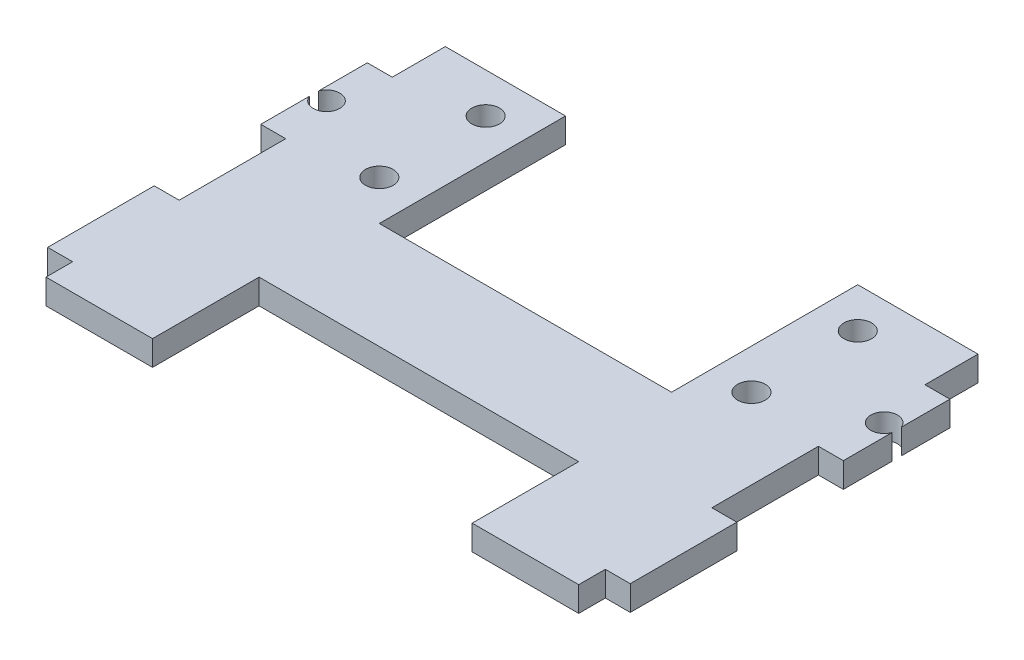
ISO-10303-21;
HEADER;
FILE_DESCRIPTION(('STEP AP214'),'2;1');
FILE_NAME('part.step','',(''),(''),'','','');
FILE_SCHEMA(('AUTOMOTIVE_DESIGN { 1 0 10303 214 1 1 1 1 }'));
ENDSEC;
DATA;
#1=APPLICATION_CONTEXT('core data for automotive mechanical design processes');
#2=APPLICATION_PROTOCOL_DEFINITION('international standard','automotive_design',2000,#1);
#3=PRODUCT_CONTEXT('',#1,'mechanical');
#4=PRODUCT('Part','Part','',(#3));
#5=PRODUCT_RELATED_PRODUCT_CATEGORY('part','',(#4));
#6=PRODUCT_DEFINITION_FORMATION('','',#4);
#7=PRODUCT_DEFINITION_CONTEXT('part definition',#1,'design');
#8=PRODUCT_DEFINITION('design','',#6,#7);
#9=PRODUCT_DEFINITION_SHAPE('','',#8);
#10=(LENGTH_UNIT() NAMED_UNIT(*) SI_UNIT(.MILLI.,.METRE.));
#11=(NAMED_UNIT(*) PLANE_ANGLE_UNIT() SI_UNIT($,.RADIAN.));
#12=(NAMED_UNIT(*) SI_UNIT($,.STERADIAN.) SOLID_ANGLE_UNIT());
#13=UNCERTAINTY_MEASURE_WITH_UNIT(LENGTH_MEASURE(1.E-05),#10,'distance_accuracy_value','');
#14=(GEOMETRIC_REPRESENTATION_CONTEXT(3) GLOBAL_UNCERTAINTY_ASSIGNED_CONTEXT((#13)) GLOBAL_UNIT_ASSIGNED_CONTEXT((#10,
#11,#12)) REPRESENTATION_CONTEXT('',''));
#15=CARTESIAN_POINT('',(0.,0.,0.));
#16=DIRECTION('',(0.,0.,1.));
#17=DIRECTION('',(1.,0.,0.));
#18=AXIS2_PLACEMENT_3D('',#15,#16,#17);
#19=CARTESIAN_POINT('',(-34.7218,2.9718,0.));
#20=DIRECTION('',(-1.,0.,0.));
#21=DIRECTION('',(0.,0.,1.));
#22=AXIS2_PLACEMENT_3D('',#19,#20,#21);
#23=PLANE('',#22);
#24=DIRECTION('',(0.,1.,0.));
#25=VECTOR('',#24,1.);
#26=CARTESIAN_POINT('',(-34.7218,0.,2.13338212915677));
#27=LINE('',#26,#25);
#28=CARTESIAN_POINT('',(-34.7218,0.,2.13338212915677));
#29=VERTEX_POINT('',#28);
#30=CARTESIAN_POINT('',(-34.7218,2.9718,2.13338212915677));
#31=VERTEX_POINT('',#30);
#32=EDGE_CURVE('E767',#29,#31,#27,.T.);
#33=ORIENTED_EDGE('',*,*,#32,.F.);
#34=DIRECTION('',(0.,0.,-1.));
#35=VECTOR('',#34,1.);
#36=CARTESIAN_POINT('',(-34.7218,0.,0.));
#37=LINE('',#36,#35);
#38=CARTESIAN_POINT('',(-34.7218,0.,7.92458212915679));
#39=VERTEX_POINT('',#38);
#40=EDGE_CURVE('E503',#39,#29,#37,.T.);
#41=ORIENTED_EDGE('',*,*,#40,.F.);
#42=DIRECTION('',(0.,-1.,0.));
#43=VECTOR('',#42,1.);
#44=CARTESIAN_POINT('',(-34.7218,2.9718,7.92458212915679));
#45=LINE('',#44,#43);
#46=CARTESIAN_POINT('',(-34.7218,2.9718,7.92458212915679));
#47=VERTEX_POINT('',#46);
#48=EDGE_CURVE('E455',#47,#39,#45,.T.);
#49=ORIENTED_EDGE('',*,*,#48,.F.);
#50=DIRECTION('',(0.,0.,-1.));
#51=VECTOR('',#50,1.);
#52=CARTESIAN_POINT('',(-34.7218,2.9718,0.));
#53=LINE('',#52,#51);
#54=EDGE_CURVE('E644',#47,#31,#53,.T.);
#55=ORIENTED_EDGE('',*,*,#54,.T.);
#56=EDGE_LOOP('',(#33,#41,#49,#55));
#57=FACE_BOUND('',#56,.T.);
#58=ADVANCED_FACE('F48',(#57),#23,.T.);
#59=CARTESIAN_POINT('',(34.7218,2.9718,0.));
#60=DIRECTION('',(-1.,0.,0.));
#61=DIRECTION('',(0.,0.,1.));
#62=AXIS2_PLACEMENT_3D('',#59,#60,#61);
#63=PLANE('',#62);
#64=DIRECTION('',(0.,0.,-1.));
#65=VECTOR('',#64,1.);
#66=CARTESIAN_POINT('',(34.7218,0.,0.));
#67=LINE('',#66,#65);
#68=CARTESIAN_POINT('',(34.7218,0.,7.92458212915679));
#69=VERTEX_POINT('',#68);
#70=CARTESIAN_POINT('',(34.7218,0.,2.13338212915677));
#71=VERTEX_POINT('',#70);
#72=EDGE_CURVE('E342',#69,#71,#67,.T.);
#73=ORIENTED_EDGE('',*,*,#72,.T.);
#74=DIRECTION('',(0.,1.,0.));
#75=VECTOR('',#74,1.);
#76=CARTESIAN_POINT('',(34.7218,0.,2.13338212915677));
#77=LINE('',#76,#75);
#78=CARTESIAN_POINT('',(34.7218,2.9718,2.13338212915677));
#79=VERTEX_POINT('',#78);
#80=EDGE_CURVE('E77',#71,#79,#77,.T.);
#81=ORIENTED_EDGE('',*,*,#80,.T.);
#82=DIRECTION('',(0.,0.,-1.));
#83=VECTOR('',#82,1.);
#84=CARTESIAN_POINT('',(34.7218,2.9718,0.));
#85=LINE('',#84,#83);
#86=CARTESIAN_POINT('',(34.7218,2.9718,7.92458212915679));
#87=VERTEX_POINT('',#86);
#88=EDGE_CURVE('E718',#87,#79,#85,.T.);
#89=ORIENTED_EDGE('',*,*,#88,.F.);
#90=DIRECTION('',(0.,-1.,0.));
#91=VECTOR('',#90,1.);
#92=CARTESIAN_POINT('',(34.7218,2.9718,7.92458212915679));
#93=LINE('',#92,#91);
#94=EDGE_CURVE('E398',#87,#69,#93,.T.);
#95=ORIENTED_EDGE('',*,*,#94,.T.);
#96=EDGE_LOOP('',(#73,#81,#89,#95));
#97=FACE_BOUND('',#96,.T.);
#98=ADVANCED_FACE('F826',(#97),#63,.F.);
#99=CARTESIAN_POINT('',(-17.4172874520488,2.9718,0.));
#100=DIRECTION('',(1.,0.,0.));
#101=DIRECTION('',(0.,0.,-1.));
#102=AXIS2_PLACEMENT_3D('',#99,#100,#101);
#103=PLANE('',#102);
#104=DIRECTION('',(0.,0.,1.));
#105=VECTOR('',#104,1.);
#106=CARTESIAN_POINT('',(-17.4172874520488,0.,0.));
#107=LINE('',#106,#105);
#108=CARTESIAN_POINT('',(-17.4172874520488,0.,-11.0995821291568));
#109=VERTEX_POINT('',#108);
#110=CARTESIAN_POINT('',(-17.4172874520488,0.,11.0995821291568));
#111=VERTEX_POINT('',#110);
#112=EDGE_CURVE('E483',#109,#111,#107,.T.);
#113=ORIENTED_EDGE('',*,*,#112,.F.);
#114=DIRECTION('',(0.,-1.,0.));
#115=VECTOR('',#114,1.);
#116=CARTESIAN_POINT('',(-17.4172874520488,2.9718,-11.0995821291568));
#117=LINE('',#116,#115);
#118=CARTESIAN_POINT('',(-17.4172874520488,2.9718,-11.0995821291568));
#119=VERTEX_POINT('',#118);
#120=EDGE_CURVE('E323',#119,#109,#117,.T.);
#121=ORIENTED_EDGE('',*,*,#120,.F.);
#122=DIRECTION('',(0.,0.,1.));
#123=VECTOR('',#122,1.);
#124=CARTESIAN_POINT('',(-17.4172874520488,2.9718,0.));
#125=LINE('',#124,#123);
#126=CARTESIAN_POINT('',(-17.4172874520488,2.9718,11.0995821291568));
#127=VERTEX_POINT('',#126);
#128=EDGE_CURVE('E623',#119,#127,#125,.T.);
#129=ORIENTED_EDGE('',*,*,#128,.T.);
#130=DIRECTION('',(0.,-1.,0.));
#131=VECTOR('',#130,1.);
#132=CARTESIAN_POINT('',(-17.4172874520488,2.9718,11.0995821291568));
#133=LINE('',#132,#131);
#134=EDGE_CURVE('E378',#127,#111,#133,.T.);
#135=ORIENTED_EDGE('',*,*,#134,.T.);
#136=EDGE_LOOP('',(#113,#121,#129,#135));
#137=FACE_BOUND('',#136,.T.);
#138=ADVANCED_FACE('F484',(#137),#103,.T.);
#139=CARTESIAN_POINT('',(0.,2.9718,-11.0995821291568));
#140=DIRECTION('',(0.,0.,-1.));
#141=DIRECTION('',(-1.,0.,0.));
#142=AXIS2_PLACEMENT_3D('',#139,#140,#141);
#143=PLANE('',#142);
#144=DIRECTION('',(1.,0.,0.));
#145=VECTOR('',#144,1.);
#146=CARTESIAN_POINT('',(0.,0.,-11.0995821291568));
#147=LINE('',#146,#145);
#148=CARTESIAN_POINT('',(-31.75,0.,-11.0995821291568));
#149=VERTEX_POINT('',#148);
#150=EDGE_CURVE('E476',#149,#109,#147,.T.);
#151=ORIENTED_EDGE('',*,*,#150,.F.);
#152=DIRECTION('',(0.,-1.,0.));
#153=VECTOR('',#152,1.);
#154=CARTESIAN_POINT('',(-31.75,2.9718,-11.0995821291568));
#155=LINE('',#154,#153);
#156=CARTESIAN_POINT('',(-31.75,2.9718,-11.0995821291568));
#157=VERTEX_POINT('',#156);
#158=EDGE_CURVE('E466',#157,#149,#155,.T.);
#159=ORIENTED_EDGE('',*,*,#158,.F.);
#160=DIRECTION('',(1.,0.,0.));
#161=VECTOR('',#160,1.);
#162=CARTESIAN_POINT('',(0.,2.9718,-11.0995821291568));
#163=LINE('',#162,#161);
#164=EDGE_CURVE('E478',#157,#119,#163,.T.);
#165=ORIENTED_EDGE('',*,*,#164,.T.);
#166=ORIENTED_EDGE('',*,*,#120,.T.);
#167=EDGE_LOOP('',(#151,#159,#165,#166));
#168=FACE_BOUND('',#167,.T.);
#169=ADVANCED_FACE('F474',(#168),#143,.T.);
#170=CARTESIAN_POINT('',(-31.75,2.9718,0.));
#171=DIRECTION('',(1.,0.,0.));
#172=DIRECTION('',(0.,0.,-1.));
#173=AXIS2_PLACEMENT_3D('',#170,#171,#172);
#174=PLANE('',#173);
#175=DIRECTION('',(0.,0.,1.));
#176=VECTOR('',#175,1.);
#177=CARTESIAN_POINT('',(-31.75,0.,0.));
#178=LINE('',#177,#176);
#179=CARTESIAN_POINT('',(-31.75,0.,-4.77541787084321));
#180=VERTEX_POINT('',#179);
#181=EDGE_CURVE('E491',#149,#180,#178,.T.);
#182=ORIENTED_EDGE('',*,*,#181,.T.);
#183=DIRECTION('',(0.,-1.,0.));
#184=VECTOR('',#183,1.);
#185=CARTESIAN_POINT('',(-31.75,2.9718,-4.77541787084321));
#186=LINE('',#185,#184);
#187=CARTESIAN_POINT('',(-31.75,2.9718,-4.77541787084321));
#188=VERTEX_POINT('',#187);
#189=EDGE_CURVE('E462',#188,#180,#186,.T.);
#190=ORIENTED_EDGE('',*,*,#189,.F.);
#191=DIRECTION('',(0.,0.,1.));
#192=VECTOR('',#191,1.);
#193=CARTESIAN_POINT('',(-31.75,2.9718,0.));
#194=LINE('',#193,#192);
#195=EDGE_CURVE('E615',#157,#188,#194,.T.);
#196=ORIENTED_EDGE('',*,*,#195,.F.);
#197=ORIENTED_EDGE('',*,*,#158,.T.);
#198=EDGE_LOOP('',(#182,#190,#196,#197));
#199=FACE_BOUND('',#198,.T.);
#200=ADVANCED_FACE('F614',(#199),#174,.F.);
#201=CARTESIAN_POINT('',(0.,2.9718,-4.77541787084323));
#202=DIRECTION('',(0.,0.,1.));
#203=DIRECTION('',(1.,0.,0.));
#204=AXIS2_PLACEMENT_3D('',#201,#202,#203);
#205=PLANE('',#204);
#206=DIRECTION('',(-1.,0.,0.));
#207=VECTOR('',#206,1.);
#208=CARTESIAN_POINT('',(0.,0.,-4.77541787084323));
#209=LINE('',#208,#207);
#210=CARTESIAN_POINT('',(-34.7218,0.,-4.77541787084321));
#211=VERTEX_POINT('',#210);
#212=EDGE_CURVE('E495',#180,#211,#209,.T.);
#213=ORIENTED_EDGE('',*,*,#212,.T.);
#214=DIRECTION('',(0.,-1.,0.));
#215=VECTOR('',#214,1.);
#216=CARTESIAN_POINT('',(-34.7218,2.9718,-4.77541787084321));
#217=LINE('',#216,#215);
#218=CARTESIAN_POINT('',(-34.7218,2.9718,-4.77541787084321));
#219=VERTEX_POINT('',#218);
#220=EDGE_CURVE('E458',#219,#211,#217,.T.);
#221=ORIENTED_EDGE('',*,*,#220,.F.);
#222=DIRECTION('',(-1.,0.,0.));
#223=VECTOR('',#222,1.);
#224=CARTESIAN_POINT('',(0.,2.9718,-4.77541787084323));
#225=LINE('',#224,#223);
#226=EDGE_CURVE('E610',#188,#219,#225,.T.);
#227=ORIENTED_EDGE('',*,*,#226,.F.);
#228=ORIENTED_EDGE('',*,*,#189,.T.);
#229=EDGE_LOOP('',(#213,#221,#227,#228));
#230=FACE_BOUND('',#229,.T.);
#231=ADVANCED_FACE('F608',(#230),#205,.F.);
#232=DIRECTION('',(0.,1.,0.));
#233=VECTOR('',#232,1.);
#234=CARTESIAN_POINT('',(-34.7218,0.,1.01578212915681));
#235=LINE('',#234,#233);
#236=CARTESIAN_POINT('',(-34.7218,2.9718,1.01578212915681));
#237=VERTEX_POINT('',#236);
#238=CARTESIAN_POINT('',(-34.7218,0.,1.01578212915681));
#239=VERTEX_POINT('',#238);
#240=EDGE_CURVE('E67',#237,#239,#235,.F.);
#241=ORIENTED_EDGE('',*,*,#240,.F.);
#242=EDGE_CURVE('E605',#237,#219,#53,.T.);
#243=ORIENTED_EDGE('',*,*,#242,.T.);
#244=ORIENTED_EDGE('',*,*,#220,.T.);
#245=EDGE_CURVE('E502',#239,#211,#37,.T.);
#246=ORIENTED_EDGE('',*,*,#245,.F.);
#247=EDGE_LOOP('',(#241,#243,#244,#246));
#248=FACE_BOUND('',#247,.T.);
#249=ADVANCED_FACE('F603',(#248),#23,.T.);
#250=CARTESIAN_POINT('',(0.,2.9718,7.92458212915679));
#251=DIRECTION('',(0.,0.,1.));
#252=DIRECTION('',(1.,0.,0.));
#253=AXIS2_PLACEMENT_3D('',#250,#251,#252);
#254=PLANE('',#253);
#255=DIRECTION('',(-1.,0.,0.));
#256=VECTOR('',#255,1.);
#257=CARTESIAN_POINT('',(0.,0.,7.92458212915679));
#258=LINE('',#257,#256);
#259=CARTESIAN_POINT('',(-31.75,0.,7.92458212915679));
#260=VERTEX_POINT('',#259);
#261=EDGE_CURVE('E506',#260,#39,#258,.T.);
#262=ORIENTED_EDGE('',*,*,#261,.F.);
#263=DIRECTION('',(0.,-1.,0.));
#264=VECTOR('',#263,1.);
#265=CARTESIAN_POINT('',(-31.75,2.9718,7.92458212915679));
#266=LINE('',#265,#264);
#267=CARTESIAN_POINT('',(-31.75,2.9718,7.92458212915679));
#268=VERTEX_POINT('',#267);
#269=EDGE_CURVE('E452',#268,#260,#266,.T.);
#270=ORIENTED_EDGE('',*,*,#269,.F.);
#271=DIRECTION('',(-1.,0.,0.));
#272=VECTOR('',#271,1.);
#273=CARTESIAN_POINT('',(0.,2.9718,7.92458212915679));
#274=LINE('',#273,#272);
#275=EDGE_CURVE('E649',#268,#47,#274,.T.);
#276=ORIENTED_EDGE('',*,*,#275,.T.);
#277=ORIENTED_EDGE('',*,*,#48,.T.);
#278=EDGE_LOOP('',(#262,#270,#276,#277));
#279=FACE_BOUND('',#278,.T.);
#280=ADVANCED_FACE('F837',(#279),#254,.T.);
#281=CARTESIAN_POINT('',(-31.75,2.9718,0.));
#282=DIRECTION('',(1.,0.,0.));
#283=DIRECTION('',(0.,0.,-1.));
#284=AXIS2_PLACEMENT_3D('',#281,#282,#283);
#285=PLANE('',#284);
#286=DIRECTION('',(0.,0.,1.));
#287=VECTOR('',#286,1.);
#288=CARTESIAN_POINT('',(-31.75,0.,0.));
#289=LINE('',#288,#287);
#290=CARTESIAN_POINT('',(-31.75,0.,20.6245821291568));
#291=VERTEX_POINT('',#290);
#292=EDGE_CURVE('E510',#260,#291,#289,.T.);
#293=ORIENTED_EDGE('',*,*,#292,.T.);
#294=DIRECTION('',(0.,-1.,0.));
#295=VECTOR('',#294,1.);
#296=CARTESIAN_POINT('',(-31.75,2.9718,20.6245821291568));
#297=LINE('',#296,#295);
#298=CARTESIAN_POINT('',(-31.75,2.9718,20.6245821291568));
#299=VERTEX_POINT('',#298);
#300=EDGE_CURVE('E448',#299,#291,#297,.T.);
#301=ORIENTED_EDGE('',*,*,#300,.F.);
#302=DIRECTION('',(0.,0.,1.));
#303=VECTOR('',#302,1.);
#304=CARTESIAN_POINT('',(-31.75,2.9718,0.));
#305=LINE('',#304,#303);
#306=EDGE_CURVE('E661',#268,#299,#305,.T.);
#307=ORIENTED_EDGE('',*,*,#306,.F.);
#308=ORIENTED_EDGE('',*,*,#269,.T.);
#309=EDGE_LOOP('',(#293,#301,#307,#308));
#310=FACE_BOUND('',#309,.T.);
#311=ADVANCED_FACE('F842',(#310),#285,.F.);
#312=CARTESIAN_POINT('',(0.,2.9718,20.6245821291568));
#313=DIRECTION('',(0.,0.,1.));
#314=DIRECTION('',(1.,0.,0.));
#315=AXIS2_PLACEMENT_3D('',#312,#313,#314);
#316=PLANE('',#315);
#317=DIRECTION('',(-1.,0.,0.));
#318=VECTOR('',#317,1.);
#319=CARTESIAN_POINT('',(0.,0.,20.6245821291568));
#320=LINE('',#319,#318);
#321=CARTESIAN_POINT('',(-34.7218,0.,20.6245821291568));
#322=VERTEX_POINT('',#321);
#323=EDGE_CURVE('E514',#291,#322,#320,.T.);
#324=ORIENTED_EDGE('',*,*,#323,.T.);
#325=DIRECTION('',(0.,-1.,0.));
#326=VECTOR('',#325,1.);
#327=CARTESIAN_POINT('',(-34.7218,2.9718,20.6245821291568));
#328=LINE('',#327,#326);
#329=CARTESIAN_POINT('',(-34.7218,2.9718,20.6245821291568));
#330=VERTEX_POINT('',#329);
#331=EDGE_CURVE('E444',#330,#322,#328,.T.);
#332=ORIENTED_EDGE('',*,*,#331,.F.);
#333=DIRECTION('',(-1.,0.,0.));
#334=VECTOR('',#333,1.);
#335=CARTESIAN_POINT('',(0.,2.9718,20.6245821291568));
#336=LINE('',#335,#334);
#337=EDGE_CURVE('E665',#299,#330,#336,.T.);
#338=ORIENTED_EDGE('',*,*,#337,.F.);
#339=ORIENTED_EDGE('',*,*,#300,.T.);
#340=EDGE_LOOP('',(#324,#332,#338,#339));
#341=FACE_BOUND('',#340,.T.);
#342=ADVANCED_FACE('F943',(#341),#316,.F.);
#343=CARTESIAN_POINT('',(-34.7218,2.9718,0.));
#344=DIRECTION('',(1.,0.,0.));
#345=DIRECTION('',(0.,0.,-1.));
#346=AXIS2_PLACEMENT_3D('',#343,#344,#345);
#347=PLANE('',#346);
#348=DIRECTION('',(0.,0.,1.));
#349=VECTOR('',#348,1.);
#350=CARTESIAN_POINT('',(-34.7218,0.,0.));
#351=LINE('',#350,#349);
#352=CARTESIAN_POINT('',(-34.7218,0.,33.3245821291568));
#353=VERTEX_POINT('',#352);
#354=EDGE_CURVE('E519',#322,#353,#351,.T.);
#355=ORIENTED_EDGE('',*,*,#354,.T.);
#356=DIRECTION('',(0.,-1.,0.));
#357=VECTOR('',#356,1.);
#358=CARTESIAN_POINT('',(-34.7218,2.9718,33.3245821291568));
#359=LINE('',#358,#357);
#360=CARTESIAN_POINT('',(-34.7218,2.9718,33.3245821291568));
#361=VERTEX_POINT('',#360);
#362=EDGE_CURVE('E441',#361,#353,#359,.T.);
#363=ORIENTED_EDGE('',*,*,#362,.F.);
#364=DIRECTION('',(0.,0.,1.));
#365=VECTOR('',#364,1.);
#366=CARTESIAN_POINT('',(-34.7218,2.9718,0.));
#367=LINE('',#366,#365);
#368=EDGE_CURVE('E788',#330,#361,#367,.T.);
#369=ORIENTED_EDGE('',*,*,#368,.F.);
#370=ORIENTED_EDGE('',*,*,#331,.T.);
#371=EDGE_LOOP('',(#355,#363,#369,#370));
#372=FACE_BOUND('',#371,.T.);
#373=ADVANCED_FACE('F939',(#372),#347,.F.);
#374=CARTESIAN_POINT('',(0.,2.9718,33.3245821291568));
#375=DIRECTION('',(0.,0.,1.));
#376=DIRECTION('',(1.,0.,0.));
#377=AXIS2_PLACEMENT_3D('',#374,#375,#376);
#378=PLANE('',#377);
#379=DIRECTION('',(-1.,0.,0.));
#380=VECTOR('',#379,1.);
#381=CARTESIAN_POINT('',(0.,0.,33.3245821291568));
#382=LINE('',#381,#380);
#383=CARTESIAN_POINT('',(-31.75,0.,33.3245821291568));
#384=VERTEX_POINT('',#383);
#385=EDGE_CURVE('E523',#384,#353,#382,.T.);
#386=ORIENTED_EDGE('',*,*,#385,.F.);
#387=DIRECTION('',(0.,-1.,0.));
#388=VECTOR('',#387,1.);
#389=CARTESIAN_POINT('',(-31.75,2.9718,33.3245821291568));
#390=LINE('',#389,#388);
#391=CARTESIAN_POINT('',(-31.75,2.9718,33.3245821291568));
#392=VERTEX_POINT('',#391);
#393=EDGE_CURVE('E438',#392,#384,#390,.T.);
#394=ORIENTED_EDGE('',*,*,#393,.F.);
#395=DIRECTION('',(-1.,0.,0.));
#396=VECTOR('',#395,1.);
#397=CARTESIAN_POINT('',(0.,2.9718,33.3245821291568));
#398=LINE('',#397,#396);
#399=EDGE_CURVE('E684',#392,#361,#398,.T.);
#400=ORIENTED_EDGE('',*,*,#399,.T.);
#401=ORIENTED_EDGE('',*,*,#362,.T.);
#402=EDGE_LOOP('',(#386,#394,#400,#401));
#403=FACE_BOUND('',#402,.T.);
#404=ADVANCED_FACE('F935',(#403),#378,.T.);
#405=CARTESIAN_POINT('',(-31.75,0.,36.4995821291568));
#406=VERTEX_POINT('',#405);
#407=EDGE_CURVE('E515',#384,#406,#289,.T.);
#408=ORIENTED_EDGE('',*,*,#407,.T.);
#409=DIRECTION('',(0.,-1.,0.));
#410=VECTOR('',#409,1.);
#411=CARTESIAN_POINT('',(-31.75,2.9718,36.4995821291568));
#412=LINE('',#411,#410);
#413=CARTESIAN_POINT('',(-31.75,2.9718,36.4995821291568));
#414=VERTEX_POINT('',#413);
#415=EDGE_CURVE('E434',#414,#406,#412,.T.);
#416=ORIENTED_EDGE('',*,*,#415,.F.);
#417=EDGE_CURVE('E666',#392,#414,#305,.T.);
#418=ORIENTED_EDGE('',*,*,#417,.F.);
#419=ORIENTED_EDGE('',*,*,#393,.T.);
#420=EDGE_LOOP('',(#408,#416,#418,#419));
#421=FACE_BOUND('',#420,.T.);
#422=ADVANCED_FACE('F932',(#421),#285,.F.);
#423=CARTESIAN_POINT('',(0.,2.9718,36.4995821291568));
#424=DIRECTION('',(0.,0.,-1.));
#425=DIRECTION('',(-1.,0.,0.));
#426=AXIS2_PLACEMENT_3D('',#423,#424,#425);
#427=PLANE('',#426);
#428=DIRECTION('',(1.,0.,0.));
#429=VECTOR('',#428,1.);
#430=CARTESIAN_POINT('',(0.,0.,36.4995821291568));
#431=LINE('',#430,#429);
#432=CARTESIAN_POINT('',(-19.05,0.,36.4995821291568));
#433=VERTEX_POINT('',#432);
#434=EDGE_CURVE('E527',#406,#433,#431,.T.);
#435=ORIENTED_EDGE('',*,*,#434,.T.);
#436=DIRECTION('',(0.,-1.,0.));
#437=VECTOR('',#436,1.);
#438=CARTESIAN_POINT('',(-19.05,2.9718,36.4995821291568));
#439=LINE('',#438,#437);
#440=CARTESIAN_POINT('',(-19.05,2.9718,36.4995821291568));
#441=VERTEX_POINT('',#440);
#442=EDGE_CURVE('E430',#441,#433,#439,.T.);
#443=ORIENTED_EDGE('',*,*,#442,.F.);
#444=DIRECTION('',(1.,0.,0.));
#445=VECTOR('',#444,1.);
#446=CARTESIAN_POINT('',(0.,2.9718,36.4995821291568));
#447=LINE('',#446,#445);
#448=EDGE_CURVE('E678',#414,#441,#447,.T.);
#449=ORIENTED_EDGE('',*,*,#448,.F.);
#450=ORIENTED_EDGE('',*,*,#415,.T.);
#451=EDGE_LOOP('',(#435,#443,#449,#450));
#452=FACE_BOUND('',#451,.T.);
#453=ADVANCED_FACE('F920',(#452),#427,.F.);
#454=CARTESIAN_POINT('',(-19.05,2.9718,0.));
#455=DIRECTION('',(-1.,0.,0.));
#456=DIRECTION('',(0.,0.,1.));
#457=AXIS2_PLACEMENT_3D('',#454,#455,#456);
#458=PLANE('',#457);
#459=DIRECTION('',(0.,0.,-1.));
#460=VECTOR('',#459,1.);
#461=CARTESIAN_POINT('',(-19.05,0.,0.));
#462=LINE('',#461,#460);
#463=CARTESIAN_POINT('',(-19.05,0.,23.7995821291568));
#464=VERTEX_POINT('',#463);
#465=EDGE_CURVE('E531',#433,#464,#462,.T.);
#466=ORIENTED_EDGE('',*,*,#465,.T.);
#467=DIRECTION('',(0.,-1.,0.));
#468=VECTOR('',#467,1.);
#469=CARTESIAN_POINT('',(-19.05,2.9718,23.7995821291568));
#470=LINE('',#469,#468);
#471=CARTESIAN_POINT('',(-19.05,2.9718,23.7995821291568));
#472=VERTEX_POINT('',#471);
#473=EDGE_CURVE('E426',#472,#464,#470,.T.);
#474=ORIENTED_EDGE('',*,*,#473,.F.);
#475=DIRECTION('',(0.,0.,-1.));
#476=VECTOR('',#475,1.);
#477=CARTESIAN_POINT('',(-19.05,2.9718,0.));
#478=LINE('',#477,#476);
#479=EDGE_CURVE('E682',#441,#472,#478,.T.);
#480=ORIENTED_EDGE('',*,*,#479,.F.);
#481=ORIENTED_EDGE('',*,*,#442,.T.);
#482=EDGE_LOOP('',(#466,#474,#480,#481));
#483=FACE_BOUND('',#482,.T.);
#484=ADVANCED_FACE('F927',(#483),#458,.F.);
#485=CARTESIAN_POINT('',(0.,2.9718,23.7995821291568));
#486=DIRECTION('',(0.,0.,-1.));
#487=DIRECTION('',(-1.,0.,0.));
#488=AXIS2_PLACEMENT_3D('',#485,#486,#487);
#489=PLANE('',#488);
#490=DIRECTION('',(1.,0.,0.));
#491=VECTOR('',#490,1.);
#492=CARTESIAN_POINT('',(0.,0.,23.7995821291568));
#493=LINE('',#492,#491);
#494=CARTESIAN_POINT('',(19.05,0.,23.7995821291568));
#495=VERTEX_POINT('',#494);
#496=EDGE_CURVE('E536',#464,#495,#493,.T.);
#497=ORIENTED_EDGE('',*,*,#496,.T.);
#498=DIRECTION('',(0.,-1.,0.));
#499=VECTOR('',#498,1.);
#500=CARTESIAN_POINT('',(19.05,2.9718,23.7995821291568));
#501=LINE('',#500,#499);
#502=CARTESIAN_POINT('',(19.05,2.9718,23.7995821291568));
#503=VERTEX_POINT('',#502);
#504=EDGE_CURVE('E423',#503,#495,#501,.T.);
#505=ORIENTED_EDGE('',*,*,#504,.F.);
#506=DIRECTION('',(1.,0.,0.));
#507=VECTOR('',#506,1.);
#508=CARTESIAN_POINT('',(0.,2.9718,23.7995821291568));
#509=LINE('',#508,#507);
#510=EDGE_CURVE('E796',#472,#503,#509,.T.);
#511=ORIENTED_EDGE('',*,*,#510,.F.);
#512=ORIENTED_EDGE('',*,*,#473,.T.);
#513=EDGE_LOOP('',(#497,#505,#511,#512));
#514=FACE_BOUND('',#513,.T.);
#515=ADVANCED_FACE('F923',(#514),#489,.F.);
#516=CARTESIAN_POINT('',(19.05,2.9718,0.));
#517=DIRECTION('',(-1.,0.,0.));
#518=DIRECTION('',(0.,0.,1.));
#519=AXIS2_PLACEMENT_3D('',#516,#517,#518);
#520=PLANE('',#519);
#521=DIRECTION('',(0.,0.,-1.));
#522=VECTOR('',#521,1.);
#523=CARTESIAN_POINT('',(19.05,0.,0.));
#524=LINE('',#523,#522);
#525=CARTESIAN_POINT('',(19.05,0.,36.4995821291568));
#526=VERTEX_POINT('',#525);
#527=EDGE_CURVE('E540',#526,#495,#524,.T.);
#528=ORIENTED_EDGE('',*,*,#527,.F.);
#529=DIRECTION('',(0.,-1.,0.));
#530=VECTOR('',#529,1.);
#531=CARTESIAN_POINT('',(19.05,2.9718,36.4995821291568));
#532=LINE('',#531,#530);
#533=CARTESIAN_POINT('',(19.05,2.9718,36.4995821291568));
#534=VERTEX_POINT('',#533);
#535=EDGE_CURVE('E420',#534,#526,#532,.T.);
#536=ORIENTED_EDGE('',*,*,#535,.F.);
#537=DIRECTION('',(0.,0.,-1.));
#538=VECTOR('',#537,1.);
#539=CARTESIAN_POINT('',(19.05,2.9718,0.));
#540=LINE('',#539,#538);
#541=EDGE_CURVE('E700',#534,#503,#540,.T.);
#542=ORIENTED_EDGE('',*,*,#541,.T.);
#543=ORIENTED_EDGE('',*,*,#504,.T.);
#544=EDGE_LOOP('',(#528,#536,#542,#543));
#545=FACE_BOUND('',#544,.T.);
#546=ADVANCED_FACE('F919',(#545),#520,.T.);
#547=CARTESIAN_POINT('',(31.75,0.,36.4995821291568));
#548=VERTEX_POINT('',#547);
#549=EDGE_CURVE('E532',#526,#548,#431,.T.);
#550=ORIENTED_EDGE('',*,*,#549,.T.);
#551=DIRECTION('',(0.,-1.,0.));
#552=VECTOR('',#551,1.);
#553=CARTESIAN_POINT('',(31.75,2.9718,36.4995821291568));
#554=LINE('',#553,#552);
#555=CARTESIAN_POINT('',(31.75,2.9718,36.4995821291568));
#556=VERTEX_POINT('',#555);
#557=EDGE_CURVE('E417',#556,#548,#554,.T.);
#558=ORIENTED_EDGE('',*,*,#557,.F.);
#559=EDGE_CURVE('E683',#534,#556,#447,.T.);
#560=ORIENTED_EDGE('',*,*,#559,.F.);
#561=ORIENTED_EDGE('',*,*,#535,.T.);
#562=EDGE_LOOP('',(#550,#558,#560,#561));
#563=FACE_BOUND('',#562,.T.);
#564=ADVANCED_FACE('F594',(#563),#427,.F.);
#565=CARTESIAN_POINT('',(31.75,2.9718,0.));
#566=DIRECTION('',(1.,0.,0.));
#567=DIRECTION('',(0.,0.,-1.));
#568=AXIS2_PLACEMENT_3D('',#565,#566,#567);
#569=PLANE('',#568);
#570=DIRECTION('',(0.,0.,1.));
#571=VECTOR('',#570,1.);
#572=CARTESIAN_POINT('',(31.75,0.,0.));
#573=LINE('',#572,#571);
#574=CARTESIAN_POINT('',(31.75,0.,33.3245821291568));
#575=VERTEX_POINT('',#574);
#576=EDGE_CURVE('E544',#575,#548,#573,.T.);
#577=ORIENTED_EDGE('',*,*,#576,.F.);
#578=DIRECTION('',(0.,-1.,0.));
#579=VECTOR('',#578,1.);
#580=CARTESIAN_POINT('',(31.75,2.9718,33.3245821291568));
#581=LINE('',#580,#579);
#582=CARTESIAN_POINT('',(31.75,2.9718,33.3245821291568));
#583=VERTEX_POINT('',#582);
#584=EDGE_CURVE('E414',#583,#575,#581,.T.);
#585=ORIENTED_EDGE('',*,*,#584,.F.);
#586=DIRECTION('',(0.,0.,1.));
#587=VECTOR('',#586,1.);
#588=CARTESIAN_POINT('',(31.75,2.9718,0.));
#589=LINE('',#588,#587);
#590=EDGE_CURVE('E591',#583,#556,#589,.T.);
#591=ORIENTED_EDGE('',*,*,#590,.T.);
#592=ORIENTED_EDGE('',*,*,#557,.T.);
#593=EDGE_LOOP('',(#577,#585,#591,#592));
#594=FACE_BOUND('',#593,.T.);
#595=ADVANCED_FACE('F585',(#594),#569,.T.);
#596=CARTESIAN_POINT('',(0.,2.9718,33.3245821291568));
#597=DIRECTION('',(0.,0.,-1.));
#598=DIRECTION('',(-1.,0.,0.));
#599=AXIS2_PLACEMENT_3D('',#596,#597,#598);
#600=PLANE('',#599);
#601=DIRECTION('',(1.,0.,0.));
#602=VECTOR('',#601,1.);
#603=CARTESIAN_POINT('',(0.,0.,33.3245821291568));
#604=LINE('',#603,#602);
#605=CARTESIAN_POINT('',(34.7218,0.,33.3245821291568));
#606=VERTEX_POINT('',#605);
#607=EDGE_CURVE('E548',#575,#606,#604,.T.);
#608=ORIENTED_EDGE('',*,*,#607,.T.);
#609=DIRECTION('',(0.,-1.,0.));
#610=VECTOR('',#609,1.);
#611=CARTESIAN_POINT('',(34.7218,2.9718,33.3245821291568));
#612=LINE('',#611,#610);
#613=CARTESIAN_POINT('',(34.7218,2.9718,33.3245821291568));
#614=VERTEX_POINT('',#613);
#615=EDGE_CURVE('E411',#614,#606,#612,.T.);
#616=ORIENTED_EDGE('',*,*,#615,.F.);
#617=DIRECTION('',(1.,0.,0.));
#618=VECTOR('',#617,1.);
#619=CARTESIAN_POINT('',(0.,2.9718,33.3245821291568));
#620=LINE('',#619,#618);
#621=EDGE_CURVE('E699',#583,#614,#620,.T.);
#622=ORIENTED_EDGE('',*,*,#621,.F.);
#623=ORIENTED_EDGE('',*,*,#584,.T.);
#624=EDGE_LOOP('',(#608,#616,#622,#623));
#625=FACE_BOUND('',#624,.T.);
#626=ADVANCED_FACE('F914',(#625),#600,.F.);
#627=CARTESIAN_POINT('',(34.7218,2.9718,0.));
#628=DIRECTION('',(1.,0.,0.));
#629=DIRECTION('',(0.,0.,-1.));
#630=AXIS2_PLACEMENT_3D('',#627,#628,#629);
#631=PLANE('',#630);
#632=DIRECTION('',(0.,0.,1.));
#633=VECTOR('',#632,1.);
#634=CARTESIAN_POINT('',(34.7218,0.,0.));
#635=LINE('',#634,#633);
#636=CARTESIAN_POINT('',(34.7218,0.,20.6245821291568));
#637=VERTEX_POINT('',#636);
#638=EDGE_CURVE('E552',#637,#606,#635,.T.);
#639=ORIENTED_EDGE('',*,*,#638,.F.);
#640=DIRECTION('',(0.,-1.,0.));
#641=VECTOR('',#640,1.);
#642=CARTESIAN_POINT('',(34.7218,2.9718,20.6245821291568));
#643=LINE('',#642,#641);
#644=CARTESIAN_POINT('',(34.7218,2.9718,20.6245821291568));
#645=VERTEX_POINT('',#644);
#646=EDGE_CURVE('E408',#645,#637,#643,.T.);
#647=ORIENTED_EDGE('',*,*,#646,.F.);
#648=DIRECTION('',(0.,0.,1.));
#649=VECTOR('',#648,1.);
#650=CARTESIAN_POINT('',(34.7218,2.9718,0.));
#651=LINE('',#650,#649);
#652=EDGE_CURVE('E802',#645,#614,#651,.T.);
#653=ORIENTED_EDGE('',*,*,#652,.T.);
#654=ORIENTED_EDGE('',*,*,#615,.T.);
#655=EDGE_LOOP('',(#639,#647,#653,#654));
#656=FACE_BOUND('',#655,.T.);
#657=ADVANCED_FACE('F578',(#656),#631,.T.);
#658=CARTESIAN_POINT('',(0.,2.9718,20.6245821291568));
#659=DIRECTION('',(0.,0.,-1.));
#660=DIRECTION('',(-1.,0.,0.));
#661=AXIS2_PLACEMENT_3D('',#658,#659,#660);
#662=PLANE('',#661);
#663=DIRECTION('',(1.,0.,0.));
#664=VECTOR('',#663,1.);
#665=CARTESIAN_POINT('',(0.,0.,20.6245821291568));
#666=LINE('',#665,#664);
#667=CARTESIAN_POINT('',(31.75,0.,20.6245821291568));
#668=VERTEX_POINT('',#667);
#669=EDGE_CURVE('E555',#668,#637,#666,.T.);
#670=ORIENTED_EDGE('',*,*,#669,.F.);
#671=DIRECTION('',(0.,-1.,0.));
#672=VECTOR('',#671,1.);
#673=CARTESIAN_POINT('',(31.75,2.9718,20.6245821291568));
#674=LINE('',#673,#672);
#675=CARTESIAN_POINT('',(31.75,2.9718,20.6245821291568));
#676=VERTEX_POINT('',#675);
#677=EDGE_CURVE('E405',#676,#668,#674,.T.);
#678=ORIENTED_EDGE('',*,*,#677,.F.);
#679=DIRECTION('',(1.,0.,0.));
#680=VECTOR('',#679,1.);
#681=CARTESIAN_POINT('',(0.,2.9718,20.6245821291568));
#682=LINE('',#681,#680);
#683=EDGE_CURVE('E574',#676,#645,#682,.T.);
#684=ORIENTED_EDGE('',*,*,#683,.T.);
#685=ORIENTED_EDGE('',*,*,#646,.T.);
#686=EDGE_LOOP('',(#670,#678,#684,#685));
#687=FACE_BOUND('',#686,.T.);
#688=ADVANCED_FACE('F572',(#687),#662,.T.);
#689=CARTESIAN_POINT('',(31.75,0.,7.92458212915679));
#690=VERTEX_POINT('',#689);
#691=EDGE_CURVE('E348',#690,#668,#573,.T.);
#692=ORIENTED_EDGE('',*,*,#691,.F.);
#693=DIRECTION('',(0.,-1.,0.));
#694=VECTOR('',#693,1.);
#695=CARTESIAN_POINT('',(31.75,2.9718,7.92458212915679));
#696=LINE('',#695,#694);
#697=CARTESIAN_POINT('',(31.75,2.9718,7.92458212915679));
#698=VERTEX_POINT('',#697);
#699=EDGE_CURVE('E402',#698,#690,#696,.T.);
#700=ORIENTED_EDGE('',*,*,#699,.F.);
#701=EDGE_CURVE('E568',#698,#676,#589,.T.);
#702=ORIENTED_EDGE('',*,*,#701,.T.);
#703=ORIENTED_EDGE('',*,*,#677,.T.);
#704=EDGE_LOOP('',(#692,#700,#702,#703));
#705=FACE_BOUND('',#704,.T.);
#706=ADVANCED_FACE('F564',(#705),#569,.T.);
#707=CARTESIAN_POINT('',(0.,2.9718,7.92458212915679));
#708=DIRECTION('',(0.,0.,-1.));
#709=DIRECTION('',(-1.,0.,0.));
#710=AXIS2_PLACEMENT_3D('',#707,#708,#709);
#711=PLANE('',#710);
#712=DIRECTION('',(1.,0.,0.));
#713=VECTOR('',#712,1.);
#714=CARTESIAN_POINT('',(0.,0.,7.92458212915679));
#715=LINE('',#714,#713);
#716=EDGE_CURVE('E343',#690,#69,#715,.T.);
#717=ORIENTED_EDGE('',*,*,#716,.T.);
#718=ORIENTED_EDGE('',*,*,#94,.F.);
#719=DIRECTION('',(1.,0.,0.));
#720=VECTOR('',#719,1.);
#721=CARTESIAN_POINT('',(0.,2.9718,7.92458212915679));
#722=LINE('',#721,#720);
#723=EDGE_CURVE('E713',#698,#87,#722,.T.);
#724=ORIENTED_EDGE('',*,*,#723,.F.);
#725=ORIENTED_EDGE('',*,*,#699,.T.);
#726=EDGE_LOOP('',(#717,#718,#724,#725));
#727=FACE_BOUND('',#726,.T.);
#728=ADVANCED_FACE('F904',(#727),#711,.F.);
#729=CARTESIAN_POINT('',(34.7218,2.9718,1.01578212915681));
#730=VERTEX_POINT('',#729);
#731=CARTESIAN_POINT('',(34.7218,2.9718,-4.77541787084321));
#732=VERTEX_POINT('',#731);
#733=EDGE_CURVE('E330',#730,#732,#85,.T.);
#734=ORIENTED_EDGE('',*,*,#733,.F.);
#735=DIRECTION('',(0.,1.,0.));
#736=VECTOR('',#735,1.);
#737=CARTESIAN_POINT('',(34.7218,0.,1.01578212915681));
#738=LINE('',#737,#736);
#739=CARTESIAN_POINT('',(34.7218,0.,1.01578212915681));
#740=VERTEX_POINT('',#739);
#741=EDGE_CURVE('E317',#730,#740,#738,.F.);
#742=ORIENTED_EDGE('',*,*,#741,.T.);
#743=CARTESIAN_POINT('',(34.7218,0.,-4.77541787084321));
#744=VERTEX_POINT('',#743);
#745=EDGE_CURVE('E328',#740,#744,#67,.T.);
#746=ORIENTED_EDGE('',*,*,#745,.T.);
#747=DIRECTION('',(0.,-1.,0.));
#748=VECTOR('',#747,1.);
#749=CARTESIAN_POINT('',(34.7218,2.9718,-4.77541787084321));
#750=LINE('',#749,#748);
#751=EDGE_CURVE('E395',#732,#744,#750,.T.);
#752=ORIENTED_EDGE('',*,*,#751,.F.);
#753=EDGE_LOOP('',(#734,#742,#746,#752));
#754=FACE_BOUND('',#753,.T.);
#755=ADVANCED_FACE('F326',(#754),#63,.F.);
#756=CARTESIAN_POINT('',(0.,2.9718,-4.77541787084323));
#757=DIRECTION('',(0.,0.,-1.));
#758=DIRECTION('',(-1.,0.,0.));
#759=AXIS2_PLACEMENT_3D('',#756,#757,#758);
#760=PLANE('',#759);
#761=DIRECTION('',(1.,0.,0.));
#762=VECTOR('',#761,1.);
#763=CARTESIAN_POINT('',(0.,0.,-4.77541787084323));
#764=LINE('',#763,#762);
#765=CARTESIAN_POINT('',(31.75,0.,-4.77541787084321));
#766=VERTEX_POINT('',#765);
#767=EDGE_CURVE('E340',#766,#744,#764,.T.);
#768=ORIENTED_EDGE('',*,*,#767,.F.);
#769=DIRECTION('',(0.,-1.,0.));
#770=VECTOR('',#769,1.);
#771=CARTESIAN_POINT('',(31.75,2.9718,-4.77541787084321));
#772=LINE('',#771,#770);
#773=CARTESIAN_POINT('',(31.75,2.9718,-4.77541787084321));
#774=VERTEX_POINT('',#773);
#775=EDGE_CURVE('E392',#774,#766,#772,.T.);
#776=ORIENTED_EDGE('',*,*,#775,.F.);
#777=DIRECTION('',(1.,0.,0.));
#778=VECTOR('',#777,1.);
#779=CARTESIAN_POINT('',(0.,2.9718,-4.77541787084323));
#780=LINE('',#779,#778);
#781=EDGE_CURVE('E723',#774,#732,#780,.T.);
#782=ORIENTED_EDGE('',*,*,#781,.T.);
#783=ORIENTED_EDGE('',*,*,#751,.T.);
#784=EDGE_LOOP('',(#768,#776,#782,#783));
#785=FACE_BOUND('',#784,.T.);
#786=ADVANCED_FACE('F898',(#785),#760,.T.);
#787=CARTESIAN_POINT('',(31.75,2.9718,0.));
#788=DIRECTION('',(1.,0.,0.));
#789=DIRECTION('',(0.,0.,-1.));
#790=AXIS2_PLACEMENT_3D('',#787,#788,#789);
#791=PLANE('',#790);
#792=DIRECTION('',(0.,0.,1.));
#793=VECTOR('',#792,1.);
#794=CARTESIAN_POINT('',(31.75,0.,0.));
#795=LINE('',#794,#793);
#796=CARTESIAN_POINT('',(31.75,0.,-11.0995821291568));
#797=VERTEX_POINT('',#796);
#798=EDGE_CURVE('E354',#797,#766,#795,.T.);
#799=ORIENTED_EDGE('',*,*,#798,.F.);
#800=DIRECTION('',(0.,-1.,0.));
#801=VECTOR('',#800,1.);
#802=CARTESIAN_POINT('',(31.75,2.9718,-11.0995821291568));
#803=LINE('',#802,#801);
#804=CARTESIAN_POINT('',(31.75,2.9718,-11.0995821291568));
#805=VERTEX_POINT('',#804);
#806=EDGE_CURVE('E389',#805,#797,#803,.T.);
#807=ORIENTED_EDGE('',*,*,#806,.F.);
#808=DIRECTION('',(0.,0.,1.));
#809=VECTOR('',#808,1.);
#810=CARTESIAN_POINT('',(31.75,2.9718,0.));
#811=LINE('',#810,#809);
#812=EDGE_CURVE('E734',#805,#774,#811,.T.);
#813=ORIENTED_EDGE('',*,*,#812,.T.);
#814=ORIENTED_EDGE('',*,*,#775,.T.);
#815=EDGE_LOOP('',(#799,#807,#813,#814));
#816=FACE_BOUND('',#815,.T.);
#817=ADVANCED_FACE('F894',(#816),#791,.T.);
#818=CARTESIAN_POINT('',(0.,2.9718,-11.0995821291568));
#819=DIRECTION('',(0.,0.,1.));
#820=DIRECTION('',(1.,0.,0.));
#821=AXIS2_PLACEMENT_3D('',#818,#819,#820);
#822=PLANE('',#821);
#823=DIRECTION('',(-1.,0.,0.));
#824=VECTOR('',#823,1.);
#825=CARTESIAN_POINT('',(0.,0.,-11.0995821291568));
#826=LINE('',#825,#824);
#827=CARTESIAN_POINT('',(17.4172874520488,0.,-11.0995821291568));
#828=VERTEX_POINT('',#827);
#829=EDGE_CURVE('E357',#797,#828,#826,.T.);
#830=ORIENTED_EDGE('',*,*,#829,.T.);
#831=DIRECTION('',(0.,-1.,0.));
#832=VECTOR('',#831,1.);
#833=CARTESIAN_POINT('',(17.4172874520488,2.9718,-11.0995821291568));
#834=LINE('',#833,#832);
#835=CARTESIAN_POINT('',(17.4172874520488,2.9718,-11.0995821291568));
#836=VERTEX_POINT('',#835);
#837=EDGE_CURVE('E385',#836,#828,#834,.T.);
#838=ORIENTED_EDGE('',*,*,#837,.F.);
#839=DIRECTION('',(-1.,0.,0.));
#840=VECTOR('',#839,1.);
#841=CARTESIAN_POINT('',(0.,2.9718,-11.0995821291568));
#842=LINE('',#841,#840);
#843=EDGE_CURVE('E738',#805,#836,#842,.T.);
#844=ORIENTED_EDGE('',*,*,#843,.F.);
#845=ORIENTED_EDGE('',*,*,#806,.T.);
#846=EDGE_LOOP('',(#830,#838,#844,#845));
#847=FACE_BOUND('',#846,.T.);
#848=ADVANCED_FACE('F888',(#847),#822,.F.);
#849=CARTESIAN_POINT('',(17.4172874520488,2.9718,0.));
#850=DIRECTION('',(1.,0.,0.));
#851=DIRECTION('',(0.,0.,-1.));
#852=AXIS2_PLACEMENT_3D('',#849,#850,#851);
#853=PLANE('',#852);
#854=DIRECTION('',(0.,0.,1.));
#855=VECTOR('',#854,1.);
#856=CARTESIAN_POINT('',(17.4172874520488,0.,0.));
#857=LINE('',#856,#855);
#858=CARTESIAN_POINT('',(17.4172874520488,0.,11.0995821291568));
#859=VERTEX_POINT('',#858);
#860=EDGE_CURVE('E361',#828,#859,#857,.T.);
#861=ORIENTED_EDGE('',*,*,#860,.T.);
#862=DIRECTION('',(0.,-1.,0.));
#863=VECTOR('',#862,1.);
#864=CARTESIAN_POINT('',(17.4172874520488,2.9718,11.0995821291568));
#865=LINE('',#864,#863);
#866=CARTESIAN_POINT('',(17.4172874520488,2.9718,11.0995821291568));
#867=VERTEX_POINT('',#866);
#868=EDGE_CURVE('E381',#867,#859,#865,.T.);
#869=ORIENTED_EDGE('',*,*,#868,.F.);
#870=DIRECTION('',(0.,0.,1.));
#871=VECTOR('',#870,1.);
#872=CARTESIAN_POINT('',(17.4172874520488,2.9718,0.));
#873=LINE('',#872,#871);
#874=EDGE_CURVE('E743',#836,#867,#873,.T.);
#875=ORIENTED_EDGE('',*,*,#874,.F.);
#876=ORIENTED_EDGE('',*,*,#837,.T.);
#877=EDGE_LOOP('',(#861,#869,#875,#876));
#878=FACE_BOUND('',#877,.T.);
#879=ADVANCED_FACE('F880',(#878),#853,.F.);
#880=CARTESIAN_POINT('',(22.1797874520488,2.9718,-6.33708212915681));
#881=DIRECTION('',(0.,-1.,0.));
#882=DIRECTION('',(0.,0.,-1.));
#883=AXIS2_PLACEMENT_3D('',#880,#881,#882);
#884=CYLINDRICAL_SURFACE('',#883,1.64764135358077);
#885=CARTESIAN_POINT('',(22.1797874520488,2.9718,-6.33708212915681));
#886=DIRECTION('',(0.,1.,0.));
#887=DIRECTION('',(0.,0.,1.));
#888=AXIS2_PLACEMENT_3D('',#885,#886,#887);
#889=CIRCLE('',#888,1.64764135358077);
#890=CARTESIAN_POINT('',(22.1797874520488,2.9718,-4.68944077557604));
#891=VERTEX_POINT('',#890);
#892=EDGE_CURVE('E752',#891,#891,#889,.T.);
#893=ORIENTED_EDGE('',*,*,#892,.T.);
#894=EDGE_LOOP('',(#893));
#895=FACE_BOUND('',#894,.T.);
#896=CARTESIAN_POINT('',(22.1797874520488,0.,-6.33708212915681));
#897=DIRECTION('',(0.,1.,0.));
#898=DIRECTION('',(0.,0.,1.));
#899=AXIS2_PLACEMENT_3D('',#896,#897,#898);
#900=CIRCLE('',#899,1.64764135358077);
#901=CARTESIAN_POINT('',(22.1797874520488,0.,-4.68944077557604));
#902=VERTEX_POINT('',#901);
#903=EDGE_CURVE('E369',#902,#902,#900,.T.);
#904=ORIENTED_EDGE('',*,*,#903,.F.);
#905=EDGE_LOOP('',(#904));
#906=FACE_BOUND('',#905,.T.);
#907=ADVANCED_FACE('F861',(#895,#906),#884,.F.);
#908=CARTESIAN_POINT('',(0.,2.9718,11.0995821291568));
#909=DIRECTION('',(0.,0.,-1.));
#910=DIRECTION('',(-1.,0.,0.));
#911=AXIS2_PLACEMENT_3D('',#908,#909,#910);
#912=PLANE('',#911);
#913=DIRECTION('',(1.,0.,0.));
#914=VECTOR('',#913,1.);
#915=CARTESIAN_POINT('',(0.,0.,11.0995821291568));
#916=LINE('',#915,#914);
#917=EDGE_CURVE('E365',#111,#859,#916,.T.);
#918=ORIENTED_EDGE('',*,*,#917,.F.);
#919=ORIENTED_EDGE('',*,*,#134,.F.);
#920=DIRECTION('',(1.,0.,0.));
#921=VECTOR('',#920,1.);
#922=CARTESIAN_POINT('',(0.,2.9718,11.0995821291568));
#923=LINE('',#922,#921);
#924=EDGE_CURVE('E747',#127,#867,#923,.T.);
#925=ORIENTED_EDGE('',*,*,#924,.T.);
#926=ORIENTED_EDGE('',*,*,#868,.T.);
#927=EDGE_LOOP('',(#918,#919,#925,#926));
#928=FACE_BOUND('',#927,.T.);
#929=ADVANCED_FACE('F854',(#928),#912,.T.);
#930=CARTESIAN_POINT('',(-22.1797874520488,2.9718,6.33708212915679));
#931=DIRECTION('',(0.,-1.,0.));
#932=DIRECTION('',(0.,0.,-1.));
#933=AXIS2_PLACEMENT_3D('',#930,#931,#932);
#934=CYLINDRICAL_SURFACE('',#933,1.64764135358077);
#935=CARTESIAN_POINT('',(-22.1797874520488,2.9718,6.33708212915679));
#936=DIRECTION('',(0.,1.,0.));
#937=DIRECTION('',(0.,0.,1.));
#938=AXIS2_PLACEMENT_3D('',#935,#936,#937);
#939=CIRCLE('',#938,1.64764135358077);
#940=CARTESIAN_POINT('',(-22.1797874520488,2.9718,7.98472348273756));
#941=VERTEX_POINT('',#940);
#942=EDGE_CURVE('E627',#941,#941,#939,.T.);
#943=ORIENTED_EDGE('',*,*,#942,.T.);
#944=EDGE_LOOP('',(#943));
#945=FACE_BOUND('',#944,.T.);
#946=CARTESIAN_POINT('',(-22.1797874520488,0.,6.33708212915679));
#947=DIRECTION('',(0.,1.,0.));
#948=DIRECTION('',(0.,0.,1.));
#949=AXIS2_PLACEMENT_3D('',#946,#947,#948);
#950=CIRCLE('',#949,1.64764135358077);
#951=CARTESIAN_POINT('',(-22.1797874520488,0.,7.98472348273756));
#952=VERTEX_POINT('',#951);
#953=EDGE_CURVE('E487',#952,#952,#950,.T.);
#954=ORIENTED_EDGE('',*,*,#953,.F.);
#955=EDGE_LOOP('',(#954));
#956=FACE_BOUND('',#955,.T.);
#957=ADVANCED_FACE('F852',(#945,#956),#934,.F.);
#958=CARTESIAN_POINT('',(-22.1797874520488,2.9718,-6.33708212915681));
#959=DIRECTION('',(0.,-1.,0.));
#960=DIRECTION('',(0.,0.,-1.));
#961=AXIS2_PLACEMENT_3D('',#958,#959,#960);
#962=CYLINDRICAL_SURFACE('',#961,1.64764135358077);
#963=CARTESIAN_POINT('',(-22.1797874520488,2.9718,-6.33708212915681));
#964=DIRECTION('',(0.,1.,0.));
#965=DIRECTION('',(0.,0.,1.));
#966=AXIS2_PLACEMENT_3D('',#963,#964,#965);
#967=CIRCLE('',#966,1.64764135358077);
#968=CARTESIAN_POINT('',(-22.1797874520488,2.9718,-4.68944077557604));
#969=VERTEX_POINT('',#968);
#970=EDGE_CURVE('E377',#969,#969,#967,.T.);
#971=ORIENTED_EDGE('',*,*,#970,.T.);
#972=EDGE_LOOP('',(#971));
#973=FACE_BOUND('',#972,.T.);
#974=CARTESIAN_POINT('',(-22.1797874520488,0.,-6.33708212915681));
#975=DIRECTION('',(0.,1.,0.));
#976=DIRECTION('',(0.,0.,1.));
#977=AXIS2_PLACEMENT_3D('',#974,#975,#976);
#978=CIRCLE('',#977,1.64764135358077);
#979=CARTESIAN_POINT('',(-22.1797874520488,0.,-4.68944077557604));
#980=VERTEX_POINT('',#979);
#981=EDGE_CURVE('E770',#980,#980,#978,.T.);
#982=ORIENTED_EDGE('',*,*,#981,.F.);
#983=EDGE_LOOP('',(#982));
#984=FACE_BOUND('',#983,.T.);
#985=ADVANCED_FACE('F50',(#973,#984),#962,.F.);
#986=CARTESIAN_POINT('',(22.1797874520488,2.9718,6.33708212915679));
#987=DIRECTION('',(0.,-1.,0.));
#988=DIRECTION('',(0.,0.,-1.));
#989=AXIS2_PLACEMENT_3D('',#986,#987,#988);
#990=CYLINDRICAL_SURFACE('',#989,1.64764135358077);
#991=CARTESIAN_POINT('',(22.1797874520488,2.9718,6.33708212915679));
#992=DIRECTION('',(0.,1.,0.));
#993=DIRECTION('',(0.,0.,1.));
#994=AXIS2_PLACEMENT_3D('',#991,#992,#993);
#995=CIRCLE('',#994,1.64764135358077);
#996=CARTESIAN_POINT('',(22.1797874520488,2.9718,7.98472348273756));
#997=VERTEX_POINT('',#996);
#998=EDGE_CURVE('E382',#997,#997,#995,.T.);
#999=ORIENTED_EDGE('',*,*,#998,.T.);
#1000=EDGE_LOOP('',(#999));
#1001=FACE_BOUND('',#1000,.T.);
#1002=CARTESIAN_POINT('',(22.1797874520488,0.,6.33708212915679));
#1003=DIRECTION('',(0.,1.,0.));
#1004=DIRECTION('',(0.,0.,1.));
#1005=AXIS2_PLACEMENT_3D('',#1002,#1003,#1004);
#1006=CIRCLE('',#1005,1.64764135358077);
#1007=CARTESIAN_POINT('',(22.1797874520488,0.,7.98472348273756));
#1008=VERTEX_POINT('',#1007);
#1009=EDGE_CURVE('E373',#1008,#1008,#1006,.T.);
#1010=ORIENTED_EDGE('',*,*,#1009,.F.);
#1011=EDGE_LOOP('',(#1010));
#1012=FACE_BOUND('',#1011,.T.);
#1013=ADVANCED_FACE('F812',(#1001,#1012),#990,.F.);
#1014=CARTESIAN_POINT('',(0.,2.9718,0.));
#1015=DIRECTION('',(0.,1.,0.));
#1016=DIRECTION('',(0.,0.,1.));
#1017=AXIS2_PLACEMENT_3D('',#1014,#1015,#1016);
#1018=PLANE('',#1017);
#1019=CARTESIAN_POINT('',(-33.2359,2.9718,1.57458212915679));
#1020=DIRECTION('',(0.,1.,0.));
#1021=DIRECTION('',(0.,0.,1.));
#1022=AXIS2_PLACEMENT_3D('',#1019,#1020,#1021);
#1023=CIRCLE('',#1022,1.5875);
#1024=EDGE_CURVE('E332',#31,#237,#1023,.T.);
#1025=ORIENTED_EDGE('',*,*,#1024,.F.);
#1026=ORIENTED_EDGE('',*,*,#54,.F.);
#1027=ORIENTED_EDGE('',*,*,#275,.F.);
#1028=ORIENTED_EDGE('',*,*,#306,.T.);
#1029=ORIENTED_EDGE('',*,*,#337,.T.);
#1030=ORIENTED_EDGE('',*,*,#368,.T.);
#1031=ORIENTED_EDGE('',*,*,#399,.F.);
#1032=ORIENTED_EDGE('',*,*,#417,.T.);
#1033=ORIENTED_EDGE('',*,*,#448,.T.);
#1034=ORIENTED_EDGE('',*,*,#479,.T.);
#1035=ORIENTED_EDGE('',*,*,#510,.T.);
#1036=ORIENTED_EDGE('',*,*,#541,.F.);
#1037=ORIENTED_EDGE('',*,*,#559,.T.);
#1038=ORIENTED_EDGE('',*,*,#590,.F.);
#1039=ORIENTED_EDGE('',*,*,#621,.T.);
#1040=ORIENTED_EDGE('',*,*,#652,.F.);
#1041=ORIENTED_EDGE('',*,*,#683,.F.);
#1042=ORIENTED_EDGE('',*,*,#701,.F.);
#1043=ORIENTED_EDGE('',*,*,#723,.T.);
#1044=ORIENTED_EDGE('',*,*,#88,.T.);
#1045=CARTESIAN_POINT('',(33.2359,2.9718,1.57458212915679));
#1046=DIRECTION('',(0.,1.,0.));
#1047=DIRECTION('',(0.,0.,1.));
#1048=AXIS2_PLACEMENT_3D('',#1045,#1046,#1047);
#1049=CIRCLE('',#1048,1.5875);
#1050=EDGE_CURVE('E774',#730,#79,#1049,.T.);
#1051=ORIENTED_EDGE('',*,*,#1050,.F.);
#1052=ORIENTED_EDGE('',*,*,#733,.T.);
#1053=ORIENTED_EDGE('',*,*,#781,.F.);
#1054=ORIENTED_EDGE('',*,*,#812,.F.);
#1055=ORIENTED_EDGE('',*,*,#843,.T.);
#1056=ORIENTED_EDGE('',*,*,#874,.T.);
#1057=ORIENTED_EDGE('',*,*,#924,.F.);
#1058=ORIENTED_EDGE('',*,*,#128,.F.);
#1059=ORIENTED_EDGE('',*,*,#164,.F.);
#1060=ORIENTED_EDGE('',*,*,#195,.T.);
#1061=ORIENTED_EDGE('',*,*,#226,.T.);
#1062=ORIENTED_EDGE('',*,*,#242,.F.);
#1063=EDGE_LOOP('',(#1025,#1026,#1027,#1028,#1029,#1030,#1031,#1032,#1033,#1034,#1035,#1036,
#1037,#1038,#1039,#1040,#1041,#1042,#1043,#1044,#1051,#1052,#1053,#1054,#1055,#1056,#1057,#1058,
#1059,#1060,#1061,#1062));
#1064=FACE_BOUND('',#1063,.T.);
#1065=ORIENTED_EDGE('',*,*,#970,.F.);
#1066=EDGE_LOOP('',(#1065));
#1067=FACE_BOUND('',#1066,.T.);
#1068=ORIENTED_EDGE('',*,*,#942,.F.);
#1069=EDGE_LOOP('',(#1068));
#1070=FACE_BOUND('',#1069,.T.);
#1071=ORIENTED_EDGE('',*,*,#892,.F.);
#1072=EDGE_LOOP('',(#1071));
#1073=FACE_BOUND('',#1072,.T.);
#1074=ORIENTED_EDGE('',*,*,#998,.F.);
#1075=EDGE_LOOP('',(#1074));
#1076=FACE_BOUND('',#1075,.T.);
#1077=ADVANCED_FACE('F620',(#1064,#1067,#1070,#1073,#1076),#1018,.T.);
#1078=CARTESIAN_POINT('',(0.,0.,0.));
#1079=DIRECTION('',(0.,1.,0.));
#1080=DIRECTION('',(0.,0.,1.));
#1081=AXIS2_PLACEMENT_3D('',#1078,#1079,#1080);
#1082=PLANE('',#1081);
#1083=ORIENTED_EDGE('',*,*,#981,.T.);
#1084=EDGE_LOOP('',(#1083));
#1085=FACE_BOUND('',#1084,.T.);
#1086=ORIENTED_EDGE('',*,*,#953,.T.);
#1087=EDGE_LOOP('',(#1086));
#1088=FACE_BOUND('',#1087,.T.);
#1089=ORIENTED_EDGE('',*,*,#40,.T.);
#1090=CARTESIAN_POINT('',(-33.2359,0.,1.57458212915679));
#1091=DIRECTION('',(0.,1.,0.));
#1092=DIRECTION('',(0.,0.,1.));
#1093=AXIS2_PLACEMENT_3D('',#1090,#1091,#1092);
#1094=CIRCLE('',#1093,1.5875);
#1095=EDGE_CURVE('E12',#29,#239,#1094,.T.);
#1096=ORIENTED_EDGE('',*,*,#1095,.T.);
#1097=ORIENTED_EDGE('',*,*,#245,.T.);
#1098=ORIENTED_EDGE('',*,*,#212,.F.);
#1099=ORIENTED_EDGE('',*,*,#181,.F.);
#1100=ORIENTED_EDGE('',*,*,#150,.T.);
#1101=ORIENTED_EDGE('',*,*,#112,.T.);
#1102=ORIENTED_EDGE('',*,*,#917,.T.);
#1103=ORIENTED_EDGE('',*,*,#860,.F.);
#1104=ORIENTED_EDGE('',*,*,#829,.F.);
#1105=ORIENTED_EDGE('',*,*,#798,.T.);
#1106=ORIENTED_EDGE('',*,*,#767,.T.);
#1107=ORIENTED_EDGE('',*,*,#745,.F.);
#1108=CARTESIAN_POINT('',(33.2359,0.,1.57458212915679));
#1109=DIRECTION('',(0.,1.,0.));
#1110=DIRECTION('',(0.,0.,1.));
#1111=AXIS2_PLACEMENT_3D('',#1108,#1109,#1110);
#1112=CIRCLE('',#1111,1.5875);
#1113=EDGE_CURVE('E57',#740,#71,#1112,.T.);
#1114=ORIENTED_EDGE('',*,*,#1113,.T.);
#1115=ORIENTED_EDGE('',*,*,#72,.F.);
#1116=ORIENTED_EDGE('',*,*,#716,.F.);
#1117=ORIENTED_EDGE('',*,*,#691,.T.);
#1118=ORIENTED_EDGE('',*,*,#669,.T.);
#1119=ORIENTED_EDGE('',*,*,#638,.T.);
#1120=ORIENTED_EDGE('',*,*,#607,.F.);
#1121=ORIENTED_EDGE('',*,*,#576,.T.);
#1122=ORIENTED_EDGE('',*,*,#549,.F.);
#1123=ORIENTED_EDGE('',*,*,#527,.T.);
#1124=ORIENTED_EDGE('',*,*,#496,.F.);
#1125=ORIENTED_EDGE('',*,*,#465,.F.);
#1126=ORIENTED_EDGE('',*,*,#434,.F.);
#1127=ORIENTED_EDGE('',*,*,#407,.F.);
#1128=ORIENTED_EDGE('',*,*,#385,.T.);
#1129=ORIENTED_EDGE('',*,*,#354,.F.);
#1130=ORIENTED_EDGE('',*,*,#323,.F.);
#1131=ORIENTED_EDGE('',*,*,#292,.F.);
#1132=ORIENTED_EDGE('',*,*,#261,.T.);
#1133=EDGE_LOOP('',(#1089,#1096,#1097,#1098,#1099,#1100,#1101,#1102,#1103,#1104,#1105,#1106,
#1107,#1114,#1115,#1116,#1117,#1118,#1119,#1120,#1121,#1122,#1123,#1124,#1125,#1126,#1127,#1128,
#1129,#1130,#1131,#1132));
#1134=FACE_BOUND('',#1133,.T.);
#1135=ORIENTED_EDGE('',*,*,#903,.T.);
#1136=EDGE_LOOP('',(#1135));
#1137=FACE_BOUND('',#1136,.T.);
#1138=ORIENTED_EDGE('',*,*,#1009,.T.);
#1139=EDGE_LOOP('',(#1138));
#1140=FACE_BOUND('',#1139,.T.);
#1141=ADVANCED_FACE('F336',(#1085,#1088,#1134,#1137,#1140),#1082,.F.);
#1142=CARTESIAN_POINT('',(33.2359,0.,1.57458212915679));
#1143=DIRECTION('',(0.,1.,0.));
#1144=DIRECTION('',(0.,0.,1.));
#1145=AXIS2_PLACEMENT_3D('',#1142,#1143,#1144);
#1146=CYLINDRICAL_SURFACE('',#1145,1.5875);
#1147=ORIENTED_EDGE('',*,*,#1113,.F.);
#1148=ORIENTED_EDGE('',*,*,#741,.F.);
#1149=ORIENTED_EDGE('',*,*,#1050,.T.);
#1150=ORIENTED_EDGE('',*,*,#80,.F.);
#1151=EDGE_LOOP('',(#1147,#1148,#1149,#1150));
#1152=FACE_BOUND('',#1151,.T.);
#1153=ADVANCED_FACE('F316',(#1152),#1146,.F.);
#1154=CARTESIAN_POINT('',(-33.2359,0.,1.57458212915679));
#1155=DIRECTION('',(0.,1.,0.));
#1156=DIRECTION('',(0.,0.,1.));
#1157=AXIS2_PLACEMENT_3D('',#1154,#1155,#1156);
#1158=CYLINDRICAL_SURFACE('',#1157,1.5875);
#1159=ORIENTED_EDGE('',*,*,#32,.T.);
#1160=ORIENTED_EDGE('',*,*,#1024,.T.);
#1161=ORIENTED_EDGE('',*,*,#240,.T.);
#1162=ORIENTED_EDGE('',*,*,#1095,.F.);
#1163=EDGE_LOOP('',(#1159,#1160,#1161,#1162));
#1164=FACE_BOUND('',#1163,.T.);
#1165=ADVANCED_FACE('F779',(#1164),#1158,.F.);
#1166=CLOSED_SHELL('',(#58,#98,#138,#169,#200,#231,#249,#280,#311,#342,#373,#404,#422,#453,#484,
#515,#546,#564,#595,#626,#657,#688,#706,#728,#755,#786,#817,#848,#879,#907,#929,#957,#985,#1013,
#1077,#1141,#1153,#1165));
#1167=MANIFOLD_SOLID_BREP('B2',#1166);
#1168=ADVANCED_BREP_SHAPE_REPRESENTATION('',(#18,#1167),#14);
#1169=SHAPE_DEFINITION_REPRESENTATION(#9,#1168);
ENDSEC;
END-ISO-10303-21;
